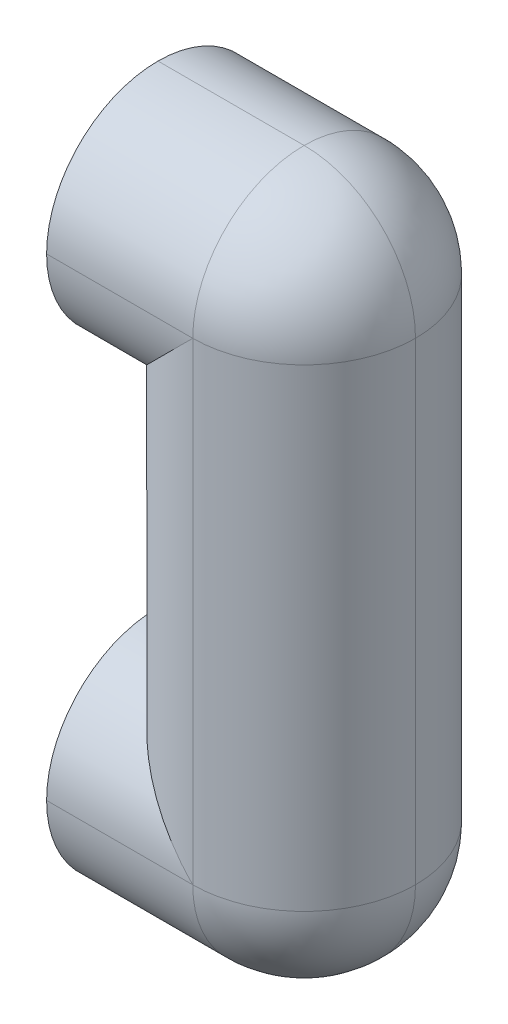
ISO-10303-21;
HEADER;
FILE_DESCRIPTION(('STEP AP214'),'2;1');
FILE_NAME('part.step','',(''),(''),'','','');
FILE_SCHEMA(('AUTOMOTIVE_DESIGN { 1 0 10303 214 1 1 1 1 }'));
ENDSEC;
DATA;
#1=APPLICATION_CONTEXT('core data for automotive mechanical design processes');
#2=APPLICATION_PROTOCOL_DEFINITION('international standard','automotive_design',2000,#1);
#3=PRODUCT_CONTEXT('',#1,'mechanical');
#4=PRODUCT('Part','Part','',(#3));
#5=PRODUCT_RELATED_PRODUCT_CATEGORY('part','',(#4));
#6=PRODUCT_DEFINITION_FORMATION('','',#4);
#7=PRODUCT_DEFINITION_CONTEXT('part definition',#1,'design');
#8=PRODUCT_DEFINITION('design','',#6,#7);
#9=PRODUCT_DEFINITION_SHAPE('','',#8);
#10=(LENGTH_UNIT() NAMED_UNIT(*) SI_UNIT(.MILLI.,.METRE.));
#11=(NAMED_UNIT(*) PLANE_ANGLE_UNIT() SI_UNIT($,.RADIAN.));
#12=(NAMED_UNIT(*) SI_UNIT($,.STERADIAN.) SOLID_ANGLE_UNIT());
#13=UNCERTAINTY_MEASURE_WITH_UNIT(LENGTH_MEASURE(1.E-05),#10,'distance_accuracy_value','');
#14=(GEOMETRIC_REPRESENTATION_CONTEXT(3) GLOBAL_UNCERTAINTY_ASSIGNED_CONTEXT((#13)) GLOBAL_UNIT_ASSIGNED_CONTEXT((#10,
#11,#12)) REPRESENTATION_CONTEXT('',''));
#15=CARTESIAN_POINT('',(0.,0.,0.));
#16=DIRECTION('',(0.,0.,1.));
#17=DIRECTION('',(1.,0.,0.));
#18=AXIS2_PLACEMENT_3D('',#15,#16,#17);
#19=CARTESIAN_POINT('',(-7.5,0.,0.));
#20=DIRECTION('',(-1.,0.,0.));
#21=DIRECTION('',(0.,0.,1.));
#22=AXIS2_PLACEMENT_3D('',#19,#20,#21);
#23=PLANE('',#22);
#24=CARTESIAN_POINT('',(-7.50000000000001,51.,-24.));
#25=DIRECTION('',(-1.,0.,0.));
#26=DIRECTION('',(0.,0.,1.));
#27=AXIS2_PLACEMENT_3D('',#24,#25,#26);
#28=CIRCLE('',#27,5.);
#29=CARTESIAN_POINT('',(-7.50000000000001,51.,-19.));
#30=VERTEX_POINT('',#29);
#31=EDGE_CURVE('E40',#30,#30,#28,.F.);
#32=ORIENTED_EDGE('',*,*,#31,.T.);
#33=EDGE_LOOP('',(#32));
#34=FACE_BOUND('',#33,.T.);
#35=CARTESIAN_POINT('',(-7.50000000000001,51.,-24.));
#36=DIRECTION('',(-1.,0.,0.));
#37=DIRECTION('',(0.,0.,1.));
#38=AXIS2_PLACEMENT_3D('',#35,#36,#37);
#39=CIRCLE('',#38,24.);
#40=CARTESIAN_POINT('',(-7.50000000000001,51.,-48.));
#41=VERTEX_POINT('',#40);
#42=CARTESIAN_POINT('',(-7.50000000000001,27.,-24.));
#43=VERTEX_POINT('',#42);
#44=EDGE_CURVE('E46',#41,#43,#39,.T.);
#45=ORIENTED_EDGE('',*,*,#44,.T.);
#46=CARTESIAN_POINT('',(-7.50000000000001,51.,-24.));
#47=DIRECTION('',(-1.,0.,0.));
#48=DIRECTION('',(0.,0.,1.));
#49=AXIS2_PLACEMENT_3D('',#46,#47,#48);
#50=CIRCLE('',#49,24.);
#51=CARTESIAN_POINT('',(-7.5,51.,0.));
#52=VERTEX_POINT('',#51);
#53=EDGE_CURVE('E11',#43,#52,#50,.T.);
#54=ORIENTED_EDGE('',*,*,#53,.T.);
#55=CARTESIAN_POINT('',(-7.50000000000001,51.,-24.));
#56=DIRECTION('',(-1.,0.,0.));
#57=DIRECTION('',(0.,0.,1.));
#58=AXIS2_PLACEMENT_3D('',#55,#56,#57);
#59=CIRCLE('',#58,24.);
#60=CARTESIAN_POINT('',(-7.50000000000001,75.,-24.));
#61=VERTEX_POINT('',#60);
#62=EDGE_CURVE('E54',#52,#61,#59,.T.);
#63=ORIENTED_EDGE('',*,*,#62,.T.);
#64=CARTESIAN_POINT('',(-7.50000000000001,51.,-24.));
#65=DIRECTION('',(-1.,0.,0.));
#66=DIRECTION('',(0.,0.,1.));
#67=AXIS2_PLACEMENT_3D('',#64,#65,#66);
#68=CIRCLE('',#67,24.);
#69=EDGE_CURVE('E119',#61,#41,#68,.T.);
#70=ORIENTED_EDGE('',*,*,#69,.T.);
#71=EDGE_LOOP('',(#45,#54,#63,#70));
#72=FACE_BOUND('',#71,.T.);
#73=ADVANCED_FACE('F36',(#34,#72),#23,.T.);
#74=CARTESIAN_POINT('',(-7.5,0.,0.));
#75=DIRECTION('',(1.,0.,0.));
#76=DIRECTION('',(0.,0.,-1.));
#77=AXIS2_PLACEMENT_3D('',#74,#75,#76);
#78=PLANE('',#77);
#79=CARTESIAN_POINT('',(-7.50000000000001,-51.,-24.));
#80=DIRECTION('',(-1.,0.,0.));
#81=DIRECTION('',(0.,0.,1.));
#82=AXIS2_PLACEMENT_3D('',#79,#80,#81);
#83=CIRCLE('',#82,5.);
#84=CARTESIAN_POINT('',(-7.50000000000001,-51.,-19.));
#85=VERTEX_POINT('',#84);
#86=EDGE_CURVE('E153',#85,#85,#83,.T.);
#87=ORIENTED_EDGE('',*,*,#86,.F.);
#88=EDGE_LOOP('',(#87));
#89=FACE_BOUND('',#88,.T.);
#90=CARTESIAN_POINT('',(-7.50000000000001,-51.,-24.));
#91=DIRECTION('',(1.,0.,0.));
#92=DIRECTION('',(0.,0.,-1.));
#93=AXIS2_PLACEMENT_3D('',#90,#91,#92);
#94=CIRCLE('',#93,24.);
#95=CARTESIAN_POINT('',(-7.50000000000001,-27.,-24.));
#96=VERTEX_POINT('',#95);
#97=CARTESIAN_POINT('',(-7.50000000000001,-51.,-48.));
#98=VERTEX_POINT('',#97);
#99=EDGE_CURVE('E104',#96,#98,#94,.F.);
#100=ORIENTED_EDGE('',*,*,#99,.T.);
#101=CARTESIAN_POINT('',(-7.50000000000001,-51.,-24.));
#102=DIRECTION('',(1.,0.,0.));
#103=DIRECTION('',(0.,0.,-1.));
#104=AXIS2_PLACEMENT_3D('',#101,#102,#103);
#105=CIRCLE('',#104,24.);
#106=CARTESIAN_POINT('',(-7.50000000000001,-75.,-24.));
#107=VERTEX_POINT('',#106);
#108=EDGE_CURVE('E157',#98,#107,#105,.F.);
#109=ORIENTED_EDGE('',*,*,#108,.T.);
#110=CARTESIAN_POINT('',(-7.50000000000001,-51.,-24.));
#111=DIRECTION('',(1.,0.,0.));
#112=DIRECTION('',(0.,0.,-1.));
#113=AXIS2_PLACEMENT_3D('',#110,#111,#112);
#114=CIRCLE('',#113,24.);
#115=CARTESIAN_POINT('',(-7.5,-51.,0.));
#116=VERTEX_POINT('',#115);
#117=EDGE_CURVE('E150',#107,#116,#114,.F.);
#118=ORIENTED_EDGE('',*,*,#117,.T.);
#119=CARTESIAN_POINT('',(-7.50000000000001,-51.,-24.));
#120=DIRECTION('',(1.,0.,0.));
#121=DIRECTION('',(0.,0.,-1.));
#122=AXIS2_PLACEMENT_3D('',#119,#120,#121);
#123=CIRCLE('',#122,24.);
#124=EDGE_CURVE('E148',#116,#96,#123,.F.);
#125=ORIENTED_EDGE('',*,*,#124,.T.);
#126=EDGE_LOOP('',(#100,#109,#118,#125));
#127=FACE_BOUND('',#126,.T.);
#128=ADVANCED_FACE('F241',(#89,#127),#78,.F.);
#129=CARTESIAN_POINT('',(0.,51.,-24.));
#130=DIRECTION('',(-1.,0.,0.));
#131=DIRECTION('',(0.,0.,1.));
#132=AXIS2_PLACEMENT_3D('',#129,#130,#131);
#133=CYLINDRICAL_SURFACE('',#132,24.);
#134=DIRECTION('',(-1.,0.,0.));
#135=VECTOR('',#134,1.);
#136=CARTESIAN_POINT('',(0.,51.,-48.));
#137=LINE('',#136,#135);
#138=CARTESIAN_POINT('',(24.,51.,-48.));
#139=VERTEX_POINT('',#138);
#140=EDGE_CURVE('E147',#41,#139,#137,.F.);
#141=ORIENTED_EDGE('',*,*,#140,.F.);
#142=ORIENTED_EDGE('',*,*,#69,.F.);
#143=DIRECTION('',(-1.,0.,0.));
#144=VECTOR('',#143,1.);
#145=CARTESIAN_POINT('',(0.,75.,-24.));
#146=LINE('',#145,#144);
#147=CARTESIAN_POINT('',(24.,75.,-24.));
#148=VERTEX_POINT('',#147);
#149=EDGE_CURVE('E96',#148,#61,#146,.T.);
#150=ORIENTED_EDGE('',*,*,#149,.F.);
#151=CARTESIAN_POINT('',(24.,51.,-24.));
#152=DIRECTION('',(1.,0.,0.));
#153=DIRECTION('',(0.,0.,-1.));
#154=AXIS2_PLACEMENT_3D('',#151,#152,#153);
#155=CIRCLE('',#154,24.);
#156=EDGE_CURVE('E141',#139,#148,#155,.T.);
#157=ORIENTED_EDGE('',*,*,#156,.F.);
#158=EDGE_LOOP('',(#141,#142,#150,#157));
#159=FACE_BOUND('',#158,.T.);
#160=ADVANCED_FACE('F38',(#159),#133,.T.);
#161=CARTESIAN_POINT('',(0.,-51.,-24.));
#162=DIRECTION('',(1.,0.,0.));
#163=DIRECTION('',(0.,0.,-1.));
#164=AXIS2_PLACEMENT_3D('',#161,#162,#163);
#165=CYLINDRICAL_SURFACE('',#164,24.);
#166=DIRECTION('',(1.,0.,0.));
#167=VECTOR('',#166,1.);
#168=CARTESIAN_POINT('',(0.,-51.,-48.));
#169=LINE('',#168,#167);
#170=CARTESIAN_POINT('',(24.,-51.,-48.));
#171=VERTEX_POINT('',#170);
#172=EDGE_CURVE('E146',#98,#171,#169,.T.);
#173=ORIENTED_EDGE('',*,*,#172,.F.);
#174=ORIENTED_EDGE('',*,*,#99,.F.);
#175=DIRECTION('',(1.,0.,0.));
#176=VECTOR('',#175,1.);
#177=CARTESIAN_POINT('',(-7.50000000000001,-27.,-24.));
#178=LINE('',#177,#176);
#179=CARTESIAN_POINT('',(0.,-27.,-24.));
#180=VERTEX_POINT('',#179);
#181=EDGE_CURVE('E89',#180,#96,#178,.F.);
#182=ORIENTED_EDGE('',*,*,#181,.F.);
#183=CARTESIAN_POINT('',(24.,-51.,-24.));
#184=DIRECTION('',(0.707106781186547,0.707106781186547,0.));
#185=DIRECTION('',(0.707106781186547,-0.707106781186547,0.));
#186=AXIS2_PLACEMENT_3D('',#183,#184,#185);
#187=ELLIPSE('',#186,33.9411254969543,24.);
#188=EDGE_CURVE('E209',#171,#180,#187,.T.);
#189=ORIENTED_EDGE('',*,*,#188,.F.);
#190=EDGE_LOOP('',(#173,#174,#182,#189));
#191=FACE_BOUND('',#190,.T.);
#192=ADVANCED_FACE('F287',(#191),#165,.T.);
#193=CARTESIAN_POINT('',(0.,-51.,-24.));
#194=DIRECTION('',(1.,0.,0.));
#195=DIRECTION('',(0.,0.,-1.));
#196=AXIS2_PLACEMENT_3D('',#193,#194,#195);
#197=CYLINDRICAL_SURFACE('',#196,24.);
#198=ORIENTED_EDGE('',*,*,#108,.F.);
#199=ORIENTED_EDGE('',*,*,#172,.T.);
#200=CARTESIAN_POINT('',(24.,-51.,-24.));
#201=DIRECTION('',(1.,0.,0.));
#202=DIRECTION('',(0.,0.,-1.));
#203=AXIS2_PLACEMENT_3D('',#200,#201,#202);
#204=CIRCLE('',#203,24.);
#205=CARTESIAN_POINT('',(24.,-75.,-24.));
#206=VERTEX_POINT('',#205);
#207=EDGE_CURVE('E206',#206,#171,#204,.T.);
#208=ORIENTED_EDGE('',*,*,#207,.F.);
#209=DIRECTION('',(-1.,0.,0.));
#210=VECTOR('',#209,1.);
#211=CARTESIAN_POINT('',(48.,-75.,-24.));
#212=LINE('',#211,#210);
#213=EDGE_CURVE('E200',#107,#206,#212,.F.);
#214=ORIENTED_EDGE('',*,*,#213,.F.);
#215=EDGE_LOOP('',(#198,#199,#208,#214));
#216=FACE_BOUND('',#215,.T.);
#217=ADVANCED_FACE('F284',(#216),#197,.T.);
#218=CARTESIAN_POINT('',(-7.50000000000001,51.,-24.));
#219=DIRECTION('',(1.,0.,0.));
#220=DIRECTION('',(0.,0.,-1.));
#221=AXIS2_PLACEMENT_3D('',#218,#219,#220);
#222=CYLINDRICAL_SURFACE('',#221,24.);
#223=DIRECTION('',(1.,0.,0.));
#224=VECTOR('',#223,1.);
#225=CARTESIAN_POINT('',(-7.50000000000001,27.,-24.));
#226=LINE('',#225,#224);
#227=CARTESIAN_POINT('',(0.,27.,-24.));
#228=VERTEX_POINT('',#227);
#229=EDGE_CURVE('E124',#43,#228,#226,.T.);
#230=ORIENTED_EDGE('',*,*,#229,.F.);
#231=ORIENTED_EDGE('',*,*,#44,.F.);
#232=ORIENTED_EDGE('',*,*,#140,.T.);
#233=CARTESIAN_POINT('',(24.,51.,-24.));
#234=DIRECTION('',(0.707106781186547,-0.707106781186547,0.));
#235=DIRECTION('',(-0.707106781186547,-0.707106781186547,0.));
#236=AXIS2_PLACEMENT_3D('',#233,#234,#235);
#237=ELLIPSE('',#236,33.9411254969543,24.);
#238=EDGE_CURVE('E127',#228,#139,#237,.T.);
#239=ORIENTED_EDGE('',*,*,#238,.F.);
#240=EDGE_LOOP('',(#230,#231,#232,#239));
#241=FACE_BOUND('',#240,.T.);
#242=ADVANCED_FACE('F125',(#241),#222,.T.);
#243=CARTESIAN_POINT('',(0.,51.,-24.));
#244=DIRECTION('',(1.,0.,0.));
#245=DIRECTION('',(0.,0.,-1.));
#246=AXIS2_PLACEMENT_3D('',#243,#244,#245);
#247=CYLINDRICAL_SURFACE('',#246,24.);
#248=DIRECTION('',(1.,0.,0.));
#249=VECTOR('',#248,1.);
#250=CARTESIAN_POINT('',(0.,51.,0.));
#251=LINE('',#250,#249);
#252=CARTESIAN_POINT('',(24.,51.,0.));
#253=VERTEX_POINT('',#252);
#254=EDGE_CURVE('E131',#52,#253,#251,.T.);
#255=ORIENTED_EDGE('',*,*,#254,.F.);
#256=ORIENTED_EDGE('',*,*,#53,.F.);
#257=ORIENTED_EDGE('',*,*,#229,.T.);
#258=CARTESIAN_POINT('',(24.,51.,-24.));
#259=DIRECTION('',(0.707106781186547,-0.707106781186547,0.));
#260=DIRECTION('',(-0.707106781186547,-0.707106781186547,0.));
#261=AXIS2_PLACEMENT_3D('',#258,#259,#260);
#262=ELLIPSE('',#261,33.9411254969543,24.);
#263=EDGE_CURVE('E136',#253,#228,#262,.T.);
#264=ORIENTED_EDGE('',*,*,#263,.F.);
#265=EDGE_LOOP('',(#255,#256,#257,#264));
#266=FACE_BOUND('',#265,.T.);
#267=ADVANCED_FACE('F134',(#266),#247,.T.);
#268=CARTESIAN_POINT('',(0.,51.,-24.));
#269=DIRECTION('',(1.,0.,0.));
#270=DIRECTION('',(0.,0.,-1.));
#271=AXIS2_PLACEMENT_3D('',#268,#269,#270);
#272=CYLINDRICAL_SURFACE('',#271,24.);
#273=CARTESIAN_POINT('',(24.,51.,-24.));
#274=DIRECTION('',(1.,0.,0.));
#275=DIRECTION('',(0.,0.,-1.));
#276=AXIS2_PLACEMENT_3D('',#273,#274,#275);
#277=CIRCLE('',#276,24.);
#278=EDGE_CURVE('E188',#148,#253,#277,.T.);
#279=ORIENTED_EDGE('',*,*,#278,.F.);
#280=ORIENTED_EDGE('',*,*,#149,.T.);
#281=ORIENTED_EDGE('',*,*,#62,.F.);
#282=ORIENTED_EDGE('',*,*,#254,.T.);
#283=EDGE_LOOP('',(#279,#280,#281,#282));
#284=FACE_BOUND('',#283,.T.);
#285=ADVANCED_FACE('F230',(#284),#272,.T.);
#286=CARTESIAN_POINT('',(24.,51.,-24.));
#287=DIRECTION('',(0.,1.,0.));
#288=DIRECTION('',(0.,0.,1.));
#289=AXIS2_PLACEMENT_3D('',#286,#287,#288);
#290=SPHERICAL_SURFACE('',#289,24.);
#291=ORIENTED_EDGE('',*,*,#156,.T.);
#292=CARTESIAN_POINT('',(24.,51.,-24.));
#293=DIRECTION('',(0.,0.,1.));
#294=DIRECTION('',(1.,0.,0.));
#295=AXIS2_PLACEMENT_3D('',#292,#293,#294);
#296=CIRCLE('',#295,24.);
#297=CARTESIAN_POINT('',(48.,51.,-24.));
#298=VERTEX_POINT('',#297);
#299=EDGE_CURVE('E186',#298,#148,#296,.T.);
#300=ORIENTED_EDGE('',*,*,#299,.F.);
#301=CARTESIAN_POINT('',(24.,51.,-24.));
#302=DIRECTION('',(0.,1.,0.));
#303=DIRECTION('',(0.,0.,1.));
#304=AXIS2_PLACEMENT_3D('',#301,#302,#303);
#305=CIRCLE('',#304,24.);
#306=EDGE_CURVE('E183',#139,#298,#305,.F.);
#307=ORIENTED_EDGE('',*,*,#306,.F.);
#308=EDGE_LOOP('',(#291,#300,#307));
#309=FACE_BOUND('',#308,.T.);
#310=ADVANCED_FACE('F214',(#309),#290,.T.);
#311=CARTESIAN_POINT('',(-7.50000000000001,-51.,-24.));
#312=DIRECTION('',(1.,0.,0.));
#313=DIRECTION('',(0.,0.,-1.));
#314=AXIS2_PLACEMENT_3D('',#311,#312,#313);
#315=CYLINDRICAL_SURFACE('',#314,24.);
#316=ORIENTED_EDGE('',*,*,#181,.T.);
#317=ORIENTED_EDGE('',*,*,#124,.F.);
#318=DIRECTION('',(1.,0.,0.));
#319=VECTOR('',#318,1.);
#320=CARTESIAN_POINT('',(0.,-51.,0.));
#321=LINE('',#320,#319);
#322=CARTESIAN_POINT('',(24.,-51.,0.));
#323=VERTEX_POINT('',#322);
#324=EDGE_CURVE('E197',#323,#116,#321,.F.);
#325=ORIENTED_EDGE('',*,*,#324,.F.);
#326=CARTESIAN_POINT('',(24.,-51.,-24.));
#327=DIRECTION('',(0.707106781186547,0.707106781186547,0.));
#328=DIRECTION('',(0.707106781186547,-0.707106781186547,0.));
#329=AXIS2_PLACEMENT_3D('',#326,#327,#328);
#330=ELLIPSE('',#329,33.9411254969543,24.);
#331=EDGE_CURVE('E194',#180,#323,#330,.T.);
#332=ORIENTED_EDGE('',*,*,#331,.F.);
#333=EDGE_LOOP('',(#316,#317,#325,#332));
#334=FACE_BOUND('',#333,.T.);
#335=ADVANCED_FACE('F237',(#334),#315,.T.);
#336=CARTESIAN_POINT('',(24.,75.,-24.));
#337=DIRECTION('',(0.,-1.,0.));
#338=DIRECTION('',(0.,0.,-1.));
#339=AXIS2_PLACEMENT_3D('',#336,#337,#338);
#340=CYLINDRICAL_SURFACE('',#339,24.);
#341=DIRECTION('',(0.,-1.,0.));
#342=VECTOR('',#341,1.);
#343=CARTESIAN_POINT('',(24.,75.,-48.));
#344=LINE('',#343,#342);
#345=EDGE_CURVE('E180',#171,#139,#344,.F.);
#346=ORIENTED_EDGE('',*,*,#345,.F.);
#347=ORIENTED_EDGE('',*,*,#188,.T.);
#348=DIRECTION('',(0.,-1.,0.));
#349=VECTOR('',#348,1.);
#350=CARTESIAN_POINT('',(0.,75.,-24.));
#351=LINE('',#350,#349);
#352=EDGE_CURVE('E191',#228,#180,#351,.T.);
#353=ORIENTED_EDGE('',*,*,#352,.F.);
#354=ORIENTED_EDGE('',*,*,#238,.T.);
#355=EDGE_LOOP('',(#346,#347,#353,#354));
#356=FACE_BOUND('',#355,.T.);
#357=ADVANCED_FACE('F217',(#356),#340,.T.);
#358=CARTESIAN_POINT('',(24.,-51.,-24.));
#359=DIRECTION('',(0.,-1.,0.));
#360=DIRECTION('',(0.,0.,-1.));
#361=AXIS2_PLACEMENT_3D('',#358,#359,#360);
#362=SPHERICAL_SURFACE('',#361,24.);
#363=CARTESIAN_POINT('',(24.,-51.,-24.));
#364=DIRECTION('',(0.,0.,-1.));
#365=DIRECTION('',(-1.,0.,0.));
#366=AXIS2_PLACEMENT_3D('',#363,#364,#365);
#367=CIRCLE('',#366,24.);
#368=CARTESIAN_POINT('',(48.,-51.,-24.));
#369=VERTEX_POINT('',#368);
#370=EDGE_CURVE('E203',#206,#369,#367,.F.);
#371=ORIENTED_EDGE('',*,*,#370,.F.);
#372=ORIENTED_EDGE('',*,*,#207,.T.);
#373=CARTESIAN_POINT('',(24.,-51.,-24.));
#374=DIRECTION('',(0.,-1.,0.));
#375=DIRECTION('',(0.,0.,-1.));
#376=AXIS2_PLACEMENT_3D('',#373,#374,#375);
#377=CIRCLE('',#376,24.);
#378=EDGE_CURVE('E177',#369,#171,#377,.F.);
#379=ORIENTED_EDGE('',*,*,#378,.F.);
#380=EDGE_LOOP('',(#371,#372,#379));
#381=FACE_BOUND('',#380,.T.);
#382=ADVANCED_FACE('F270',(#381),#362,.T.);
#383=CARTESIAN_POINT('',(0.,-51.,-24.));
#384=DIRECTION('',(-1.,0.,0.));
#385=DIRECTION('',(0.,0.,1.));
#386=AXIS2_PLACEMENT_3D('',#383,#384,#385);
#387=CYLINDRICAL_SURFACE('',#386,24.);
#388=ORIENTED_EDGE('',*,*,#117,.F.);
#389=ORIENTED_EDGE('',*,*,#213,.T.);
#390=CARTESIAN_POINT('',(24.,-51.,-24.));
#391=DIRECTION('',(1.,0.,0.));
#392=DIRECTION('',(0.,0.,-1.));
#393=AXIS2_PLACEMENT_3D('',#390,#391,#392);
#394=CIRCLE('',#393,24.);
#395=EDGE_CURVE('E174',#323,#206,#394,.T.);
#396=ORIENTED_EDGE('',*,*,#395,.F.);
#397=ORIENTED_EDGE('',*,*,#324,.T.);
#398=EDGE_LOOP('',(#388,#389,#396,#397));
#399=FACE_BOUND('',#398,.T.);
#400=ADVANCED_FACE('F267',(#399),#387,.T.);
#401=CARTESIAN_POINT('',(24.,75.,-24.));
#402=DIRECTION('',(0.,-1.,0.));
#403=DIRECTION('',(0.,0.,-1.));
#404=AXIS2_PLACEMENT_3D('',#401,#402,#403);
#405=CYLINDRICAL_SURFACE('',#404,24.);
#406=ORIENTED_EDGE('',*,*,#352,.T.);
#407=ORIENTED_EDGE('',*,*,#331,.T.);
#408=DIRECTION('',(0.,-1.,0.));
#409=VECTOR('',#408,1.);
#410=CARTESIAN_POINT('',(24.,75.,0.));
#411=LINE('',#410,#409);
#412=EDGE_CURVE('E171',#253,#323,#411,.T.);
#413=ORIENTED_EDGE('',*,*,#412,.F.);
#414=ORIENTED_EDGE('',*,*,#263,.T.);
#415=EDGE_LOOP('',(#406,#407,#413,#414));
#416=FACE_BOUND('',#415,.T.);
#417=ADVANCED_FACE('F221',(#416),#405,.T.);
#418=CARTESIAN_POINT('',(24.,51.,-24.));
#419=DIRECTION('',(0.,1.,0.));
#420=DIRECTION('',(0.,0.,1.));
#421=AXIS2_PLACEMENT_3D('',#418,#419,#420);
#422=SPHERICAL_SURFACE('',#421,24.);
#423=ORIENTED_EDGE('',*,*,#299,.T.);
#424=ORIENTED_EDGE('',*,*,#278,.T.);
#425=CARTESIAN_POINT('',(24.,51.,-24.));
#426=DIRECTION('',(0.,1.,0.));
#427=DIRECTION('',(0.,0.,1.));
#428=AXIS2_PLACEMENT_3D('',#425,#426,#427);
#429=CIRCLE('',#428,24.);
#430=EDGE_CURVE('E168',#298,#253,#429,.F.);
#431=ORIENTED_EDGE('',*,*,#430,.F.);
#432=EDGE_LOOP('',(#423,#424,#431));
#433=FACE_BOUND('',#432,.T.);
#434=ADVANCED_FACE('F229',(#433),#422,.T.);
#435=CARTESIAN_POINT('',(24.,75.,-24.));
#436=DIRECTION('',(0.,-1.,0.));
#437=DIRECTION('',(0.,0.,-1.));
#438=AXIS2_PLACEMENT_3D('',#435,#436,#437);
#439=CYLINDRICAL_SURFACE('',#438,24.);
#440=ORIENTED_EDGE('',*,*,#345,.T.);
#441=ORIENTED_EDGE('',*,*,#306,.T.);
#442=DIRECTION('',(0.,-1.,0.));
#443=VECTOR('',#442,1.);
#444=CARTESIAN_POINT('',(48.,75.,-24.));
#445=LINE('',#444,#443);
#446=EDGE_CURVE('E164',#369,#298,#445,.F.);
#447=ORIENTED_EDGE('',*,*,#446,.F.);
#448=ORIENTED_EDGE('',*,*,#378,.T.);
#449=EDGE_LOOP('',(#440,#441,#447,#448));
#450=FACE_BOUND('',#449,.T.);
#451=ADVANCED_FACE('F258',(#450),#439,.T.);
#452=CARTESIAN_POINT('',(24.,-51.,-24.));
#453=DIRECTION('',(0.,-1.,0.));
#454=DIRECTION('',(0.,0.,-1.));
#455=AXIS2_PLACEMENT_3D('',#452,#453,#454);
#456=SPHERICAL_SURFACE('',#455,24.);
#457=ORIENTED_EDGE('',*,*,#395,.T.);
#458=ORIENTED_EDGE('',*,*,#370,.T.);
#459=CARTESIAN_POINT('',(24.,-51.,-24.));
#460=DIRECTION('',(0.,-1.,0.));
#461=DIRECTION('',(0.,0.,-1.));
#462=AXIS2_PLACEMENT_3D('',#459,#460,#461);
#463=CIRCLE('',#462,24.);
#464=EDGE_CURVE('E161',#323,#369,#463,.F.);
#465=ORIENTED_EDGE('',*,*,#464,.F.);
#466=EDGE_LOOP('',(#457,#458,#465));
#467=FACE_BOUND('',#466,.T.);
#468=ADVANCED_FACE('F255',(#467),#456,.T.);
#469=CARTESIAN_POINT('',(24.,75.,-24.));
#470=DIRECTION('',(0.,-1.,0.));
#471=DIRECTION('',(0.,0.,-1.));
#472=AXIS2_PLACEMENT_3D('',#469,#470,#471);
#473=CYLINDRICAL_SURFACE('',#472,24.);
#474=ORIENTED_EDGE('',*,*,#430,.T.);
#475=ORIENTED_EDGE('',*,*,#412,.T.);
#476=ORIENTED_EDGE('',*,*,#464,.T.);
#477=ORIENTED_EDGE('',*,*,#446,.T.);
#478=EDGE_LOOP('',(#474,#475,#476,#477));
#479=FACE_BOUND('',#478,.T.);
#480=ADVANCED_FACE('F226',(#479),#473,.T.);
#481=CARTESIAN_POINT('',(7.49999999999999,-51.,-24.));
#482=DIRECTION('',(-1.,0.,0.));
#483=DIRECTION('',(0.,0.,1.));
#484=AXIS2_PLACEMENT_3D('',#481,#482,#483);
#485=CYLINDRICAL_SURFACE('',#484,5.);
#486=CARTESIAN_POINT('',(7.49999999999999,-51.,-24.));
#487=DIRECTION('',(-1.,0.,0.));
#488=DIRECTION('',(0.,0.,1.));
#489=AXIS2_PLACEMENT_3D('',#486,#487,#488);
#490=CIRCLE('',#489,5.);
#491=CARTESIAN_POINT('',(7.49999999999999,-51.,-19.));
#492=VERTEX_POINT('',#491);
#493=EDGE_CURVE('E165',#492,#492,#490,.T.);
#494=ORIENTED_EDGE('',*,*,#493,.F.);
#495=EDGE_LOOP('',(#494));
#496=FACE_BOUND('',#495,.T.);
#497=ORIENTED_EDGE('',*,*,#86,.T.);
#498=EDGE_LOOP('',(#497));
#499=FACE_BOUND('',#498,.T.);
#500=ADVANCED_FACE('F254',(#496,#499),#485,.F.);
#501=CARTESIAN_POINT('',(7.49999999999999,-51.,-24.));
#502=DIRECTION('',(-1.,0.,0.));
#503=DIRECTION('',(0.,0.,1.));
#504=AXIS2_PLACEMENT_3D('',#501,#502,#503);
#505=PLANE('',#504);
#506=ORIENTED_EDGE('',*,*,#493,.T.);
#507=EDGE_LOOP('',(#506));
#508=FACE_BOUND('',#507,.T.);
#509=ADVANCED_FACE('F390',(#508),#505,.T.);
#510=CARTESIAN_POINT('',(-15.,51.,-24.));
#511=DIRECTION('',(1.,0.,0.));
#512=DIRECTION('',(0.,0.,-1.));
#513=AXIS2_PLACEMENT_3D('',#510,#511,#512);
#514=CYLINDRICAL_SURFACE('',#513,5.);
#515=ORIENTED_EDGE('',*,*,#31,.F.);
#516=EDGE_LOOP('',(#515));
#517=FACE_BOUND('',#516,.T.);
#518=CARTESIAN_POINT('',(-15.,51.,-24.));
#519=DIRECTION('',(-1.,0.,0.));
#520=DIRECTION('',(0.,0.,1.));
#521=AXIS2_PLACEMENT_3D('',#518,#519,#520);
#522=CIRCLE('',#521,5.);
#523=CARTESIAN_POINT('',(-15.,51.,-19.));
#524=VERTEX_POINT('',#523);
#525=EDGE_CURVE('E476',#524,#524,#522,.T.);
#526=ORIENTED_EDGE('',*,*,#525,.F.);
#527=EDGE_LOOP('',(#526));
#528=FACE_BOUND('',#527,.T.);
#529=ADVANCED_FACE('F399',(#517,#528),#514,.T.);
#530=CARTESIAN_POINT('',(-15.,51.,-24.));
#531=DIRECTION('',(-1.,0.,0.));
#532=DIRECTION('',(0.,0.,1.));
#533=AXIS2_PLACEMENT_3D('',#530,#531,#532);
#534=PLANE('',#533);
#535=ORIENTED_EDGE('',*,*,#525,.T.);
#536=EDGE_LOOP('',(#535));
#537=FACE_BOUND('',#536,.T.);
#538=ADVANCED_FACE('F415',(#537),#534,.T.);
#539=CLOSED_SHELL('',(#73,#128,#160,#192,#217,#242,#267,#285,#310,#335,#357,#382,#400,#417,#434,
#451,#468,#480,#500,#509,#529,#538));
#540=MANIFOLD_SOLID_BREP('B2',#539);
#541=ADVANCED_BREP_SHAPE_REPRESENTATION('',(#18,#540),#14);
#542=SHAPE_DEFINITION_REPRESENTATION(#9,#541);
ENDSEC;
END-ISO-10303-21;
